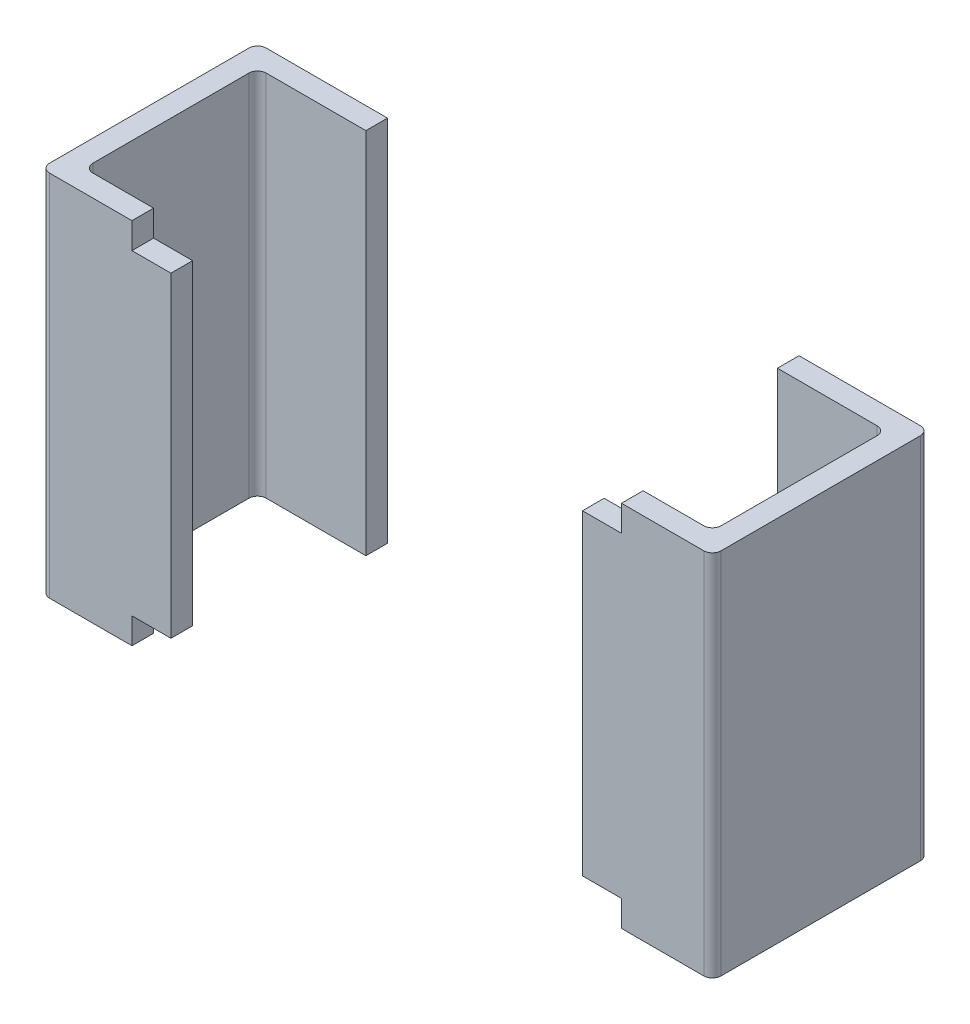
ISO-10303-21;
HEADER;
FILE_DESCRIPTION(('STEP AP214'),'2;1');
FILE_NAME('part.step','',(''),(''),'','','');
FILE_SCHEMA(('AUTOMOTIVE_DESIGN { 1 0 10303 214 1 1 1 1 }'));
ENDSEC;
DATA;
#1=APPLICATION_CONTEXT('core data for automotive mechanical design processes');
#2=APPLICATION_PROTOCOL_DEFINITION('international standard','automotive_design',2000,#1);
#3=PRODUCT_CONTEXT('',#1,'mechanical');
#4=PRODUCT('Part','Part','',(#3));
#5=PRODUCT_RELATED_PRODUCT_CATEGORY('part','',(#4));
#6=PRODUCT_DEFINITION_FORMATION('','',#4);
#7=PRODUCT_DEFINITION_CONTEXT('part definition',#1,'design');
#8=PRODUCT_DEFINITION('design','',#6,#7);
#9=PRODUCT_DEFINITION_SHAPE('','',#8);
#10=(LENGTH_UNIT() NAMED_UNIT(*) SI_UNIT(.MILLI.,.METRE.));
#11=(NAMED_UNIT(*) PLANE_ANGLE_UNIT() SI_UNIT($,.RADIAN.));
#12=(NAMED_UNIT(*) SI_UNIT($,.STERADIAN.) SOLID_ANGLE_UNIT());
#13=UNCERTAINTY_MEASURE_WITH_UNIT(LENGTH_MEASURE(1.E-05),#10,'distance_accuracy_value','');
#14=(GEOMETRIC_REPRESENTATION_CONTEXT(3) GLOBAL_UNCERTAINTY_ASSIGNED_CONTEXT((#13)) GLOBAL_UNIT_ASSIGNED_CONTEXT((#10,
#11,#12)) REPRESENTATION_CONTEXT('',''));
#15=CARTESIAN_POINT('',(0.,0.,0.));
#16=DIRECTION('',(0.,0.,1.));
#17=DIRECTION('',(1.,0.,0.));
#18=AXIS2_PLACEMENT_3D('',#15,#16,#17);
#19=CARTESIAN_POINT('',(-0.705,0.425,0.43));
#20=DIRECTION('',(0.,1.,0.));
#21=DIRECTION('',(-0.707106781186548,0.,0.707106781186548));
#22=AXIS2_PLACEMENT_3D('',#19,#20,#21);
#23=CYLINDRICAL_SURFACE('',#22,0.02);
#24=CARTESIAN_POINT('',(-0.705,-0.425,0.43));
#25=DIRECTION('',(0.,-1.,0.));
#26=DIRECTION('',(-0.707106781186548,0.,0.707106781186548));
#27=AXIS2_PLACEMENT_3D('',#24,#25,#26);
#28=CIRCLE('',#27,0.02);
#29=CARTESIAN_POINT('',(-0.705,-0.425,0.45));
#30=VERTEX_POINT('',#29);
#31=CARTESIAN_POINT('',(-0.725,-0.425,0.43));
#32=VERTEX_POINT('',#31);
#33=EDGE_CURVE('P0_E11',#30,#32,#28,.T.);
#34=ORIENTED_EDGE('',*,*,#33,.T.);
#35=DIRECTION('',(0.,1.,0.));
#36=VECTOR('',#35,1.);
#37=CARTESIAN_POINT('',(-0.725,0.425,0.43));
#38=LINE('',#37,#36);
#39=CARTESIAN_POINT('',(-0.725,0.425,0.43));
#40=VERTEX_POINT('',#39);
#41=EDGE_CURVE('P0_E27',#32,#40,#38,.T.);
#42=ORIENTED_EDGE('',*,*,#41,.T.);
#43=CARTESIAN_POINT('',(-0.705,0.425,0.43));
#44=DIRECTION('',(0.,1.,0.));
#45=DIRECTION('',(-0.707106781186548,0.,0.707106781186548));
#46=AXIS2_PLACEMENT_3D('',#43,#44,#45);
#47=CIRCLE('',#46,0.02);
#48=CARTESIAN_POINT('',(-0.705,0.425,0.45));
#49=VERTEX_POINT('',#48);
#50=EDGE_CURVE('P0_E213',#40,#49,#47,.T.);
#51=ORIENTED_EDGE('',*,*,#50,.T.);
#52=DIRECTION('',(0.,-1.,0.));
#53=VECTOR('',#52,1.);
#54=CARTESIAN_POINT('',(-0.705,0.425,0.45));
#55=LINE('',#54,#53);
#56=EDGE_CURVE('P0_E170',#49,#30,#55,.T.);
#57=ORIENTED_EDGE('',*,*,#56,.T.);
#58=EDGE_LOOP('',(#34,#42,#51,#57));
#59=FACE_BOUND('',#58,.T.);
#60=ADVANCED_FACE('P0_F16',(#59),#23,.F.);
#61=CARTESIAN_POINT('',(-0.725,0.425,0.05));
#62=DIRECTION('',(-1.,0.,0.));
#63=DIRECTION('',(0.,1.,0.));
#64=AXIS2_PLACEMENT_3D('',#61,#62,#63);
#65=PLANE('',#64);
#66=ORIENTED_EDGE('',*,*,#41,.F.);
#67=DIRECTION('',(0.,0.,1.));
#68=VECTOR('',#67,1.);
#69=CARTESIAN_POINT('',(-0.725,-0.425,0.025));
#70=LINE('',#69,#68);
#71=CARTESIAN_POINT('',(-0.725,-0.425,0.07));
#72=VERTEX_POINT('',#71);
#73=EDGE_CURVE('P0_E267',#72,#32,#70,.T.);
#74=ORIENTED_EDGE('',*,*,#73,.F.);
#75=DIRECTION('',(0.,-1.,0.));
#76=VECTOR('',#75,1.);
#77=CARTESIAN_POINT('',(-0.725,0.425,0.07));
#78=LINE('',#77,#76);
#79=CARTESIAN_POINT('',(-0.725,0.425,0.07));
#80=VERTEX_POINT('',#79);
#81=EDGE_CURVE('P0_E203',#80,#72,#78,.T.);
#82=ORIENTED_EDGE('',*,*,#81,.F.);
#83=DIRECTION('',(0.,0.,-1.));
#84=VECTOR('',#83,1.);
#85=CARTESIAN_POINT('',(-0.725,0.425,0.025));
#86=LINE('',#85,#84);
#87=EDGE_CURVE('P0_E245',#40,#80,#86,.T.);
#88=ORIENTED_EDGE('',*,*,#87,.F.);
#89=EDGE_LOOP('',(#66,#74,#82,#88));
#90=FACE_BOUND('',#89,.T.);
#91=ADVANCED_FACE('P0_F548',(#90),#65,.F.);
#92=CARTESIAN_POINT('',(-0.755,0.2125,0.48));
#93=DIRECTION('',(0.,-1.,0.));
#94=DIRECTION('',(-0.707106781186548,0.,0.707106781186548));
#95=AXIS2_PLACEMENT_3D('',#92,#93,#94);
#96=CYLINDRICAL_SURFACE('',#95,0.02);
#97=CARTESIAN_POINT('',(-0.755,-0.425,0.48));
#98=DIRECTION('',(0.,1.,0.));
#99=DIRECTION('',(-0.707106781186548,0.,0.707106781186548));
#100=AXIS2_PLACEMENT_3D('',#97,#98,#99);
#101=CIRCLE('',#100,0.02);
#102=CARTESIAN_POINT('',(-0.775,-0.425,0.48));
#103=VERTEX_POINT('',#102);
#104=CARTESIAN_POINT('',(-0.755,-0.425,0.5));
#105=VERTEX_POINT('',#104);
#106=EDGE_CURVE('P0_E156',#103,#105,#101,.T.);
#107=ORIENTED_EDGE('',*,*,#106,.T.);
#108=DIRECTION('',(0.,1.,0.));
#109=VECTOR('',#108,1.);
#110=CARTESIAN_POINT('',(-0.755,0.2125,0.5));
#111=LINE('',#110,#109);
#112=CARTESIAN_POINT('',(-0.755,0.425,0.5));
#113=VERTEX_POINT('',#112);
#114=EDGE_CURVE('P0_E171',#105,#113,#111,.T.);
#115=ORIENTED_EDGE('',*,*,#114,.T.);
#116=CARTESIAN_POINT('',(-0.755,0.425,0.48));
#117=DIRECTION('',(0.,-1.,0.));
#118=DIRECTION('',(-0.707106781186548,0.,0.707106781186548));
#119=AXIS2_PLACEMENT_3D('',#116,#117,#118);
#120=CIRCLE('',#119,0.02);
#121=CARTESIAN_POINT('',(-0.775,0.425,0.48));
#122=VERTEX_POINT('',#121);
#123=EDGE_CURVE('P0_E158',#113,#122,#120,.T.);
#124=ORIENTED_EDGE('',*,*,#123,.T.);
#125=DIRECTION('',(0.,-1.,0.));
#126=VECTOR('',#125,1.);
#127=CARTESIAN_POINT('',(-0.775,0.2125,0.48));
#128=LINE('',#127,#126);
#129=EDGE_CURVE('P0_E145',#122,#103,#128,.T.);
#130=ORIENTED_EDGE('',*,*,#129,.T.);
#131=EDGE_LOOP('',(#107,#115,#124,#130));
#132=FACE_BOUND('',#131,.T.);
#133=ADVANCED_FACE('P0_F154',(#132),#96,.T.);
#134=CARTESIAN_POINT('',(0.,0.,0.5));
#135=DIRECTION('',(0.,0.,1.));
#136=DIRECTION('',(1.,0.,0.));
#137=AXIS2_PLACEMENT_3D('',#134,#135,#136);
#138=PLANE('',#137);
#139=ORIENTED_EDGE('',*,*,#114,.F.);
#140=DIRECTION('',(1.,0.,0.));
#141=VECTOR('',#140,1.);
#142=CARTESIAN_POINT('',(-0.775,-0.425,0.5));
#143=LINE('',#142,#141);
#144=CARTESIAN_POINT('',(-0.565,-0.425,0.5));
#145=VERTEX_POINT('',#144);
#146=EDGE_CURVE('P0_E161',#105,#145,#143,.T.);
#147=ORIENTED_EDGE('',*,*,#146,.T.);
#148=DIRECTION('',(0.,1.,0.));
#149=VECTOR('',#148,1.);
#150=CARTESIAN_POINT('',(-0.565,-0.2125,0.5));
#151=LINE('',#150,#149);
#152=CARTESIAN_POINT('',(-0.565,-0.365,0.5));
#153=VERTEX_POINT('',#152);
#154=EDGE_CURVE('P0_E224',#145,#153,#151,.T.);
#155=ORIENTED_EDGE('',*,*,#154,.T.);
#156=DIRECTION('',(1.,0.,0.));
#157=VECTOR('',#156,1.);
#158=CARTESIAN_POINT('',(-0.2825,-0.365,0.5));
#159=LINE('',#158,#157);
#160=CARTESIAN_POINT('',(-0.475,-0.365,0.5));
#161=VERTEX_POINT('',#160);
#162=EDGE_CURVE('P0_E229',#153,#161,#159,.T.);
#163=ORIENTED_EDGE('',*,*,#162,.T.);
#164=DIRECTION('',(0.,1.,0.));
#165=VECTOR('',#164,1.);
#166=CARTESIAN_POINT('',(-0.475,0.2125,0.5));
#167=LINE('',#166,#165);
#168=CARTESIAN_POINT('',(-0.475,0.365,0.5));
#169=VERTEX_POINT('',#168);
#170=EDGE_CURVE('P0_E226',#161,#169,#167,.T.);
#171=ORIENTED_EDGE('',*,*,#170,.T.);
#172=DIRECTION('',(-1.,0.,0.));
#173=VECTOR('',#172,1.);
#174=CARTESIAN_POINT('',(-0.2375,0.365,0.5));
#175=LINE('',#174,#173);
#176=CARTESIAN_POINT('',(-0.565,0.365,0.5));
#177=VERTEX_POINT('',#176);
#178=EDGE_CURVE('P0_E100',#169,#177,#175,.T.);
#179=ORIENTED_EDGE('',*,*,#178,.T.);
#180=DIRECTION('',(0.,1.,0.));
#181=VECTOR('',#180,1.);
#182=CARTESIAN_POINT('',(-0.565,0.1825,0.5));
#183=LINE('',#182,#181);
#184=CARTESIAN_POINT('',(-0.565,0.425,0.5));
#185=VERTEX_POINT('',#184);
#186=EDGE_CURVE('P0_E20',#177,#185,#183,.T.);
#187=ORIENTED_EDGE('',*,*,#186,.T.);
#188=DIRECTION('',(-1.,0.,0.));
#189=VECTOR('',#188,1.);
#190=CARTESIAN_POINT('',(0.775,0.425,0.5));
#191=LINE('',#190,#189);
#192=EDGE_CURVE('P0_E254',#185,#113,#191,.T.);
#193=ORIENTED_EDGE('',*,*,#192,.T.);
#194=EDGE_LOOP('',(#139,#147,#155,#163,#171,#179,#187,#193));
#195=FACE_BOUND('',#194,.T.);
#196=ADVANCED_FACE('P0_F381',(#195),#138,.T.);
#197=CARTESIAN_POINT('',(-0.775,-0.425,0.));
#198=DIRECTION('',(0.,-1.,0.));
#199=DIRECTION('',(0.,0.,-1.));
#200=AXIS2_PLACEMENT_3D('',#197,#198,#199);
#201=PLANE('',#200);
#202=ORIENTED_EDGE('',*,*,#106,.F.);
#203=DIRECTION('',(0.,0.,1.));
#204=VECTOR('',#203,1.);
#205=CARTESIAN_POINT('',(-0.775,-0.425,0.));
#206=LINE('',#205,#204);
#207=CARTESIAN_POINT('',(-0.775,-0.425,0.02));
#208=VERTEX_POINT('',#207);
#209=EDGE_CURVE('P0_E165',#208,#103,#206,.T.);
#210=ORIENTED_EDGE('',*,*,#209,.F.);
#211=CARTESIAN_POINT('',(-0.755,-0.425,0.02));
#212=DIRECTION('',(0.,1.,0.));
#213=DIRECTION('',(-0.707106781186548,0.,-0.707106781186548));
#214=AXIS2_PLACEMENT_3D('',#211,#212,#213);
#215=CIRCLE('',#214,0.02);
#216=CARTESIAN_POINT('',(-0.755,-0.425,0.));
#217=VERTEX_POINT('',#216);
#218=EDGE_CURVE('P0_E235',#217,#208,#215,.T.);
#219=ORIENTED_EDGE('',*,*,#218,.F.);
#220=DIRECTION('',(1.,0.,0.));
#221=VECTOR('',#220,1.);
#222=CARTESIAN_POINT('',(-0.775,-0.425,0.));
#223=LINE('',#222,#221);
#224=CARTESIAN_POINT('',(-0.475,-0.425,0.));
#225=VERTEX_POINT('',#224);
#226=EDGE_CURVE('P0_E250',#217,#225,#223,.T.);
#227=ORIENTED_EDGE('',*,*,#226,.T.);
#228=DIRECTION('',(0.,0.,1.));
#229=VECTOR('',#228,1.);
#230=CARTESIAN_POINT('',(-0.475,-0.425,-0.01854871206285));
#231=LINE('',#230,#229);
#232=CARTESIAN_POINT('',(-0.475,-0.425,0.05));
#233=VERTEX_POINT('',#232);
#234=EDGE_CURVE('P0_E255',#225,#233,#231,.T.);
#235=ORIENTED_EDGE('',*,*,#234,.T.);
#236=DIRECTION('',(-1.,0.,0.));
#237=VECTOR('',#236,1.);
#238=CARTESIAN_POINT('',(-0.025,-0.425,0.05));
#239=LINE('',#238,#237);
#240=CARTESIAN_POINT('',(-0.705,-0.425,0.05));
#241=VERTEX_POINT('',#240);
#242=EDGE_CURVE('P0_E263',#233,#241,#239,.T.);
#243=ORIENTED_EDGE('',*,*,#242,.T.);
#244=CARTESIAN_POINT('',(-0.705,-0.425,0.07));
#245=DIRECTION('',(0.,-1.,0.));
#246=DIRECTION('',(-0.707106781186548,0.,-0.707106781186548));
#247=AXIS2_PLACEMENT_3D('',#244,#245,#246);
#248=CIRCLE('',#247,0.02);
#249=EDGE_CURVE('P0_E194',#72,#241,#248,.T.);
#250=ORIENTED_EDGE('',*,*,#249,.F.);
#251=ORIENTED_EDGE('',*,*,#73,.T.);
#252=ORIENTED_EDGE('',*,*,#33,.F.);
#253=DIRECTION('',(1.,0.,0.));
#254=VECTOR('',#253,1.);
#255=CARTESIAN_POINT('',(-0.75,-0.425,0.45));
#256=LINE('',#255,#254);
#257=CARTESIAN_POINT('',(-0.565,-0.425,0.45));
#258=VERTEX_POINT('',#257);
#259=EDGE_CURVE('P0_E262',#30,#258,#256,.T.);
#260=ORIENTED_EDGE('',*,*,#259,.T.);
#261=DIRECTION('',(0.,0.,1.));
#262=VECTOR('',#261,1.);
#263=CARTESIAN_POINT('',(-0.565,-0.425,0.25));
#264=LINE('',#263,#262);
#265=EDGE_CURVE('P0_E238',#258,#145,#264,.T.);
#266=ORIENTED_EDGE('',*,*,#265,.T.);
#267=ORIENTED_EDGE('',*,*,#146,.F.);
#268=EDGE_LOOP('',(#202,#210,#219,#227,#235,#243,#250,#251,#252,#260,#266,#267));
#269=FACE_BOUND('',#268,.T.);
#270=ADVANCED_FACE('P0_F164',(#269),#201,.T.);
#271=CARTESIAN_POINT('',(-0.755,0.2125,0.02));
#272=DIRECTION('',(0.,-1.,0.));
#273=DIRECTION('',(-0.707106781186548,0.,-0.707106781186548));
#274=AXIS2_PLACEMENT_3D('',#271,#272,#273);
#275=CYLINDRICAL_SURFACE('',#274,0.02);
#276=ORIENTED_EDGE('',*,*,#218,.T.);
#277=DIRECTION('',(0.,1.,0.));
#278=VECTOR('',#277,1.);
#279=CARTESIAN_POINT('',(-0.775,0.2125,0.02));
#280=LINE('',#279,#278);
#281=CARTESIAN_POINT('',(-0.775,0.425,0.02));
#282=VERTEX_POINT('',#281);
#283=EDGE_CURVE('P0_E176',#208,#282,#280,.T.);
#284=ORIENTED_EDGE('',*,*,#283,.T.);
#285=CARTESIAN_POINT('',(-0.755,0.425,0.02));
#286=DIRECTION('',(0.,-1.,0.));
#287=DIRECTION('',(-0.707106781186548,0.,-0.707106781186548));
#288=AXIS2_PLACEMENT_3D('',#285,#286,#287);
#289=CIRCLE('',#288,0.02);
#290=CARTESIAN_POINT('',(-0.755,0.425,0.));
#291=VERTEX_POINT('',#290);
#292=EDGE_CURVE('P0_E289',#282,#291,#289,.T.);
#293=ORIENTED_EDGE('',*,*,#292,.T.);
#294=DIRECTION('',(0.,-1.,0.));
#295=VECTOR('',#294,1.);
#296=CARTESIAN_POINT('',(-0.755,0.2125,0.));
#297=LINE('',#296,#295);
#298=EDGE_CURVE('P0_E259',#291,#217,#297,.T.);
#299=ORIENTED_EDGE('',*,*,#298,.T.);
#300=EDGE_LOOP('',(#276,#284,#293,#299));
#301=FACE_BOUND('',#300,.T.);
#302=ADVANCED_FACE('P0_F318',(#301),#275,.T.);
#303=CARTESIAN_POINT('',(0.,0.,0.));
#304=DIRECTION('',(0.,0.,1.));
#305=DIRECTION('',(1.,0.,0.));
#306=AXIS2_PLACEMENT_3D('',#303,#304,#305);
#307=PLANE('',#306);
#308=ORIENTED_EDGE('',*,*,#298,.F.);
#309=DIRECTION('',(-1.,0.,0.));
#310=VECTOR('',#309,1.);
#311=CARTESIAN_POINT('',(0.775,0.425,0.));
#312=LINE('',#311,#310);
#313=CARTESIAN_POINT('',(-0.475,0.425,0.));
#314=VERTEX_POINT('',#313);
#315=EDGE_CURVE('P0_E214',#314,#291,#312,.T.);
#316=ORIENTED_EDGE('',*,*,#315,.F.);
#317=DIRECTION('',(0.,-1.,0.));
#318=VECTOR('',#317,1.);
#319=CARTESIAN_POINT('',(-0.475,0.2125,0.));
#320=LINE('',#319,#318);
#321=EDGE_CURVE('P0_E197',#314,#225,#320,.T.);
#322=ORIENTED_EDGE('',*,*,#321,.T.);
#323=ORIENTED_EDGE('',*,*,#226,.F.);
#324=EDGE_LOOP('',(#308,#316,#322,#323));
#325=FACE_BOUND('',#324,.T.);
#326=ADVANCED_FACE('P0_F325',(#325),#307,.F.);
#327=CARTESIAN_POINT('',(-0.705,0.425,0.07));
#328=DIRECTION('',(0.,1.,0.));
#329=DIRECTION('',(-0.707106781186548,0.,-0.707106781186548));
#330=AXIS2_PLACEMENT_3D('',#327,#328,#329);
#331=CYLINDRICAL_SURFACE('',#330,0.02);
#332=ORIENTED_EDGE('',*,*,#249,.T.);
#333=DIRECTION('',(0.,1.,0.));
#334=VECTOR('',#333,1.);
#335=CARTESIAN_POINT('',(-0.705,0.425,0.05));
#336=LINE('',#335,#334);
#337=CARTESIAN_POINT('',(-0.705,0.425,0.05));
#338=VERTEX_POINT('',#337);
#339=EDGE_CURVE('P0_E198',#241,#338,#336,.T.);
#340=ORIENTED_EDGE('',*,*,#339,.T.);
#341=CARTESIAN_POINT('',(-0.705,0.425,0.07));
#342=DIRECTION('',(0.,1.,0.));
#343=DIRECTION('',(-0.707106781186548,0.,-0.707106781186548));
#344=AXIS2_PLACEMENT_3D('',#341,#342,#343);
#345=CIRCLE('',#344,0.02);
#346=EDGE_CURVE('P0_E222',#338,#80,#345,.T.);
#347=ORIENTED_EDGE('',*,*,#346,.T.);
#348=ORIENTED_EDGE('',*,*,#81,.T.);
#349=EDGE_LOOP('',(#332,#340,#347,#348));
#350=FACE_BOUND('',#349,.T.);
#351=ADVANCED_FACE('P0_F563',(#350),#331,.F.);
#352=CARTESIAN_POINT('',(0.725,0.425,0.05));
#353=DIRECTION('',(0.,0.,-1.));
#354=DIRECTION('',(0.,-1.,0.));
#355=AXIS2_PLACEMENT_3D('',#352,#353,#354);
#356=PLANE('',#355);
#357=ORIENTED_EDGE('',*,*,#339,.F.);
#358=ORIENTED_EDGE('',*,*,#242,.F.);
#359=DIRECTION('',(0.,1.,0.));
#360=VECTOR('',#359,1.);
#361=CARTESIAN_POINT('',(-0.475,0.425,0.05));
#362=LINE('',#361,#360);
#363=CARTESIAN_POINT('',(-0.475,0.425,0.05));
#364=VERTEX_POINT('',#363);
#365=EDGE_CURVE('P0_E199',#233,#364,#362,.T.);
#366=ORIENTED_EDGE('',*,*,#365,.T.);
#367=DIRECTION('',(1.,0.,0.));
#368=VECTOR('',#367,1.);
#369=CARTESIAN_POINT('',(0.75,0.425,0.05));
#370=LINE('',#369,#368);
#371=EDGE_CURVE('P0_E242',#338,#364,#370,.T.);
#372=ORIENTED_EDGE('',*,*,#371,.F.);
#373=EDGE_LOOP('',(#357,#358,#366,#372));
#374=FACE_BOUND('',#373,.T.);
#375=ADVANCED_FACE('P0_F565',(#374),#356,.F.);
#376=CARTESIAN_POINT('',(-0.565,-0.365,0.5));
#377=DIRECTION('',(0.,1.,0.));
#378=DIRECTION('',(1.,0.,0.));
#379=AXIS2_PLACEMENT_3D('',#376,#377,#378);
#380=PLANE('',#379);
#381=DIRECTION('',(-1.,0.,0.));
#382=VECTOR('',#381,1.);
#383=CARTESIAN_POINT('',(-0.645,-0.365,0.45));
#384=LINE('',#383,#382);
#385=CARTESIAN_POINT('',(-0.475,-0.365,0.45));
#386=VERTEX_POINT('',#385);
#387=CARTESIAN_POINT('',(-0.565,-0.365,0.45));
#388=VERTEX_POINT('',#387);
#389=EDGE_CURVE('P0_E205',#386,#388,#384,.T.);
#390=ORIENTED_EDGE('',*,*,#389,.F.);
#391=DIRECTION('',(0.,0.,-1.));
#392=VECTOR('',#391,1.);
#393=CARTESIAN_POINT('',(-0.475,-0.365,0.45));
#394=LINE('',#393,#392);
#395=EDGE_CURVE('P0_E187',#161,#386,#394,.T.);
#396=ORIENTED_EDGE('',*,*,#395,.F.);
#397=ORIENTED_EDGE('',*,*,#162,.F.);
#398=DIRECTION('',(0.,0.,-1.));
#399=VECTOR('',#398,1.);
#400=CARTESIAN_POINT('',(-0.565,-0.365,0.5));
#401=LINE('',#400,#399);
#402=EDGE_CURVE('P0_E204',#153,#388,#401,.T.);
#403=ORIENTED_EDGE('',*,*,#402,.T.);
#404=EDGE_LOOP('',(#390,#396,#397,#403));
#405=FACE_BOUND('',#404,.T.);
#406=ADVANCED_FACE('P0_F533',(#405),#380,.F.);
#407=CARTESIAN_POINT('',(-0.565,-0.425,0.5));
#408=DIRECTION('',(-1.,0.,0.));
#409=DIRECTION('',(0.,0.,1.));
#410=AXIS2_PLACEMENT_3D('',#407,#408,#409);
#411=PLANE('',#410);
#412=DIRECTION('',(0.,-1.,0.));
#413=VECTOR('',#412,1.);
#414=CARTESIAN_POINT('',(-0.565,0.,0.45));
#415=LINE('',#414,#413);
#416=EDGE_CURVE('P0_E210',#388,#258,#415,.T.);
#417=ORIENTED_EDGE('',*,*,#416,.F.);
#418=ORIENTED_EDGE('',*,*,#402,.F.);
#419=ORIENTED_EDGE('',*,*,#154,.F.);
#420=ORIENTED_EDGE('',*,*,#265,.F.);
#421=EDGE_LOOP('',(#417,#418,#419,#420));
#422=FACE_BOUND('',#421,.T.);
#423=ADVANCED_FACE('P0_F18',(#422),#411,.F.);
#424=CARTESIAN_POINT('',(-0.475,0.365,0.5));
#425=DIRECTION('',(0.,-1.,0.));
#426=DIRECTION('',(0.,0.,-1.));
#427=AXIS2_PLACEMENT_3D('',#424,#425,#426);
#428=PLANE('',#427);
#429=DIRECTION('',(1.,0.,0.));
#430=VECTOR('',#429,1.);
#431=CARTESIAN_POINT('',(-0.6,0.365,0.45));
#432=LINE('',#431,#430);
#433=CARTESIAN_POINT('',(-0.565,0.365,0.45));
#434=VERTEX_POINT('',#433);
#435=CARTESIAN_POINT('',(-0.475,0.365,0.45));
#436=VERTEX_POINT('',#435);
#437=EDGE_CURVE('P0_E307',#434,#436,#432,.T.);
#438=ORIENTED_EDGE('',*,*,#437,.F.);
#439=DIRECTION('',(0.,0.,-1.));
#440=VECTOR('',#439,1.);
#441=CARTESIAN_POINT('',(-0.565,0.365,0.5));
#442=LINE('',#441,#440);
#443=EDGE_CURVE('P0_E246',#177,#434,#442,.T.);
#444=ORIENTED_EDGE('',*,*,#443,.F.);
#445=ORIENTED_EDGE('',*,*,#178,.F.);
#446=DIRECTION('',(0.,0.,1.));
#447=VECTOR('',#446,1.);
#448=CARTESIAN_POINT('',(-0.475,0.365,0.45));
#449=LINE('',#448,#447);
#450=EDGE_CURVE('P0_E178',#436,#169,#449,.T.);
#451=ORIENTED_EDGE('',*,*,#450,.F.);
#452=EDGE_LOOP('',(#438,#444,#445,#451));
#453=FACE_BOUND('',#452,.T.);
#454=ADVANCED_FACE('P0_F536',(#453),#428,.F.);
#455=CARTESIAN_POINT('',(-0.565,0.365,0.5));
#456=DIRECTION('',(-1.,0.,0.));
#457=DIRECTION('',(0.,0.,1.));
#458=AXIS2_PLACEMENT_3D('',#455,#456,#457);
#459=PLANE('',#458);
#460=DIRECTION('',(0.,-1.,0.));
#461=VECTOR('',#460,1.);
#462=CARTESIAN_POINT('',(-0.565,0.395,0.45));
#463=LINE('',#462,#461);
#464=CARTESIAN_POINT('',(-0.565,0.425,0.45));
#465=VERTEX_POINT('',#464);
#466=EDGE_CURVE('P0_E249',#465,#434,#463,.T.);
#467=ORIENTED_EDGE('',*,*,#466,.F.);
#468=DIRECTION('',(0.,0.,-1.));
#469=VECTOR('',#468,1.);
#470=CARTESIAN_POINT('',(-0.565,0.425,0.25));
#471=LINE('',#470,#469);
#472=EDGE_CURVE('P0_E179',#185,#465,#471,.T.);
#473=ORIENTED_EDGE('',*,*,#472,.F.);
#474=ORIENTED_EDGE('',*,*,#186,.F.);
#475=ORIENTED_EDGE('',*,*,#443,.T.);
#476=EDGE_LOOP('',(#467,#473,#474,#475));
#477=FACE_BOUND('',#476,.T.);
#478=ADVANCED_FACE('P0_F367',(#477),#459,.F.);
#479=CARTESIAN_POINT('',(-0.725,0.425,0.45));
#480=DIRECTION('',(0.,0.,1.));
#481=DIRECTION('',(1.,0.,0.));
#482=AXIS2_PLACEMENT_3D('',#479,#480,#481);
#483=PLANE('',#482);
#484=ORIENTED_EDGE('',*,*,#56,.F.);
#485=DIRECTION('',(-1.,0.,0.));
#486=VECTOR('',#485,1.);
#487=CARTESIAN_POINT('',(0.025,0.425,0.45));
#488=LINE('',#487,#486);
#489=EDGE_CURVE('P0_E189',#465,#49,#488,.T.);
#490=ORIENTED_EDGE('',*,*,#489,.F.);
#491=ORIENTED_EDGE('',*,*,#466,.T.);
#492=ORIENTED_EDGE('',*,*,#437,.T.);
#493=DIRECTION('',(0.,-1.,0.));
#494=VECTOR('',#493,1.);
#495=CARTESIAN_POINT('',(-0.475,0.425,0.45));
#496=LINE('',#495,#494);
#497=EDGE_CURVE('P0_E209',#436,#386,#496,.T.);
#498=ORIENTED_EDGE('',*,*,#497,.T.);
#499=ORIENTED_EDGE('',*,*,#389,.T.);
#500=ORIENTED_EDGE('',*,*,#416,.T.);
#501=ORIENTED_EDGE('',*,*,#259,.F.);
#502=EDGE_LOOP('',(#484,#490,#491,#492,#498,#499,#500,#501));
#503=FACE_BOUND('',#502,.T.);
#504=ADVANCED_FACE('P0_F362',(#503),#483,.F.);
#505=CARTESIAN_POINT('',(-0.475,0.425,0.4));
#506=DIRECTION('',(-1.,0.,0.));
#507=DIRECTION('',(0.,1.,0.));
#508=AXIS2_PLACEMENT_3D('',#505,#506,#507);
#509=PLANE('',#508);
#510=ORIENTED_EDGE('',*,*,#395,.T.);
#511=ORIENTED_EDGE('',*,*,#497,.F.);
#512=ORIENTED_EDGE('',*,*,#450,.T.);
#513=ORIENTED_EDGE('',*,*,#170,.F.);
#514=EDGE_LOOP('',(#510,#511,#512,#513));
#515=FACE_BOUND('',#514,.T.);
#516=ADVANCED_FACE('P0_F531',(#515),#509,.F.);
#517=CARTESIAN_POINT('',(-0.775,0.425,0.));
#518=DIRECTION('',(-1.,0.,0.));
#519=DIRECTION('',(0.,0.,1.));
#520=AXIS2_PLACEMENT_3D('',#517,#518,#519);
#521=PLANE('',#520);
#522=ORIENTED_EDGE('',*,*,#129,.F.);
#523=DIRECTION('',(0.,0.,1.));
#524=VECTOR('',#523,1.);
#525=CARTESIAN_POINT('',(-0.775,0.425,0.));
#526=LINE('',#525,#524);
#527=EDGE_CURVE('P0_E218',#282,#122,#526,.T.);
#528=ORIENTED_EDGE('',*,*,#527,.F.);
#529=ORIENTED_EDGE('',*,*,#283,.F.);
#530=ORIENTED_EDGE('',*,*,#209,.T.);
#531=EDGE_LOOP('',(#522,#528,#529,#530));
#532=FACE_BOUND('',#531,.T.);
#533=ADVANCED_FACE('P0_F174',(#532),#521,.T.);
#534=CARTESIAN_POINT('',(0.775,0.425,0.));
#535=DIRECTION('',(0.,1.,0.));
#536=DIRECTION('',(1.,0.,0.));
#537=AXIS2_PLACEMENT_3D('',#534,#535,#536);
#538=PLANE('',#537);
#539=ORIENTED_EDGE('',*,*,#123,.F.);
#540=ORIENTED_EDGE('',*,*,#192,.F.);
#541=ORIENTED_EDGE('',*,*,#472,.T.);
#542=ORIENTED_EDGE('',*,*,#489,.T.);
#543=ORIENTED_EDGE('',*,*,#50,.F.);
#544=ORIENTED_EDGE('',*,*,#87,.T.);
#545=ORIENTED_EDGE('',*,*,#346,.F.);
#546=ORIENTED_EDGE('',*,*,#371,.T.);
#547=DIRECTION('',(0.,0.,-1.));
#548=VECTOR('',#547,1.);
#549=CARTESIAN_POINT('',(-0.475,0.425,-0.01854871206285));
#550=LINE('',#549,#548);
#551=EDGE_CURVE('P0_E217',#364,#314,#550,.T.);
#552=ORIENTED_EDGE('',*,*,#551,.T.);
#553=ORIENTED_EDGE('',*,*,#315,.T.);
#554=ORIENTED_EDGE('',*,*,#292,.F.);
#555=ORIENTED_EDGE('',*,*,#527,.T.);
#556=EDGE_LOOP('',(#539,#540,#541,#542,#543,#544,#545,#546,#552,#553,#554,#555));
#557=FACE_BOUND('',#556,.T.);
#558=ADVANCED_FACE('P0_F320',(#557),#538,.T.);
#559=CARTESIAN_POINT('',(-0.475,0.425,-0.03709742412571));
#560=DIRECTION('',(-1.,0.,0.));
#561=DIRECTION('',(0.,1.,0.));
#562=AXIS2_PLACEMENT_3D('',#559,#560,#561);
#563=PLANE('',#562);
#564=ORIENTED_EDGE('',*,*,#234,.F.);
#565=ORIENTED_EDGE('',*,*,#321,.F.);
#566=ORIENTED_EDGE('',*,*,#551,.F.);
#567=ORIENTED_EDGE('',*,*,#365,.F.);
#568=EDGE_LOOP('',(#564,#565,#566,#567));
#569=FACE_BOUND('',#568,.T.);
#570=ADVANCED_FACE('P0_F328',(#569),#563,.F.);
#571=CLOSED_SHELL('',(#60,#91,#133,#196,#270,#302,#326,#351,#375,#406,#423,#454,#478,#504,#516,
#533,#558,#570));
#572=MANIFOLD_SOLID_BREP('P0_B1',#571);
#573=CARTESIAN_POINT('',(0.705,0.425,0.07));
#574=DIRECTION('',(0.,-1.,0.));
#575=DIRECTION('',(0.707106781186548,0.,-0.707106781186548));
#576=AXIS2_PLACEMENT_3D('',#573,#574,#575);
#577=CYLINDRICAL_SURFACE('',#576,0.02);
#578=CARTESIAN_POINT('',(0.705,0.425,0.07));
#579=DIRECTION('',(0.,1.,0.));
#580=DIRECTION('',(0.707106781186548,0.,-0.707106781186548));
#581=AXIS2_PLACEMENT_3D('',#578,#579,#580);
#582=CIRCLE('',#581,0.02);
#583=CARTESIAN_POINT('',(0.725,0.425,0.07));
#584=VERTEX_POINT('',#583);
#585=CARTESIAN_POINT('',(0.705,0.425,0.05));
#586=VERTEX_POINT('',#585);
#587=EDGE_CURVE('P1_E11',#584,#586,#582,.T.);
#588=ORIENTED_EDGE('',*,*,#587,.T.);
#589=DIRECTION('',(0.,-1.,0.));
#590=VECTOR('',#589,1.);
#591=CARTESIAN_POINT('',(0.705,0.425,0.05));
#592=LINE('',#591,#590);
#593=CARTESIAN_POINT('',(0.705,-0.425,0.05));
#594=VERTEX_POINT('',#593);
#595=EDGE_CURVE('P1_E27',#586,#594,#592,.T.);
#596=ORIENTED_EDGE('',*,*,#595,.T.);
#597=CARTESIAN_POINT('',(0.705,-0.425,0.07));
#598=DIRECTION('',(0.,-1.,0.));
#599=DIRECTION('',(0.707106781186548,0.,-0.707106781186548));
#600=AXIS2_PLACEMENT_3D('',#597,#598,#599);
#601=CIRCLE('',#600,0.02);
#602=CARTESIAN_POINT('',(0.725,-0.425,0.07));
#603=VERTEX_POINT('',#602);
#604=EDGE_CURVE('P1_E158',#594,#603,#601,.T.);
#605=ORIENTED_EDGE('',*,*,#604,.T.);
#606=DIRECTION('',(0.,1.,0.));
#607=VECTOR('',#606,1.);
#608=CARTESIAN_POINT('',(0.725,0.425,0.07));
#609=LINE('',#608,#607);
#610=EDGE_CURVE('P1_E171',#603,#584,#609,.T.);
#611=ORIENTED_EDGE('',*,*,#610,.T.);
#612=EDGE_LOOP('',(#588,#596,#605,#611));
#613=FACE_BOUND('',#612,.T.);
#614=ADVANCED_FACE('P1_F16',(#613),#577,.F.);
#615=CARTESIAN_POINT('',(0.725,0.425,0.05));
#616=DIRECTION('',(0.,0.,-1.));
#617=DIRECTION('',(0.,-1.,0.));
#618=AXIS2_PLACEMENT_3D('',#615,#616,#617);
#619=PLANE('',#618);
#620=ORIENTED_EDGE('',*,*,#595,.F.);
#621=DIRECTION('',(1.,0.,0.));
#622=VECTOR('',#621,1.);
#623=CARTESIAN_POINT('',(0.75,0.425,0.05));
#624=LINE('',#623,#622);
#625=CARTESIAN_POINT('',(0.475,0.425,0.05));
#626=VERTEX_POINT('',#625);
#627=EDGE_CURVE('P1_E166',#626,#586,#624,.T.);
#628=ORIENTED_EDGE('',*,*,#627,.F.);
#629=DIRECTION('',(0.,-1.,0.));
#630=VECTOR('',#629,1.);
#631=CARTESIAN_POINT('',(0.475,0.425,0.05));
#632=LINE('',#631,#630);
#633=CARTESIAN_POINT('',(0.475,-0.425,0.05));
#634=VERTEX_POINT('',#633);
#635=EDGE_CURVE('P1_E163',#626,#634,#632,.T.);
#636=ORIENTED_EDGE('',*,*,#635,.T.);
#637=DIRECTION('',(-1.,0.,0.));
#638=VECTOR('',#637,1.);
#639=CARTESIAN_POINT('',(-0.025,-0.425,0.05));
#640=LINE('',#639,#638);
#641=EDGE_CURVE('P1_E150',#594,#634,#640,.T.);
#642=ORIENTED_EDGE('',*,*,#641,.F.);
#643=EDGE_LOOP('',(#620,#628,#636,#642));
#644=FACE_BOUND('',#643,.T.);
#645=ADVANCED_FACE('P1_F164',(#644),#619,.F.);
#646=CARTESIAN_POINT('',(0.755,-0.2125,0.02));
#647=DIRECTION('',(0.,1.,0.));
#648=DIRECTION('',(0.707106781186548,0.,-0.707106781186548));
#649=AXIS2_PLACEMENT_3D('',#646,#647,#648);
#650=CYLINDRICAL_SURFACE('',#649,0.02);
#651=CARTESIAN_POINT('',(0.755,0.425,0.02));
#652=DIRECTION('',(0.,-1.,0.));
#653=DIRECTION('',(0.707106781186548,0.,-0.707106781186548));
#654=AXIS2_PLACEMENT_3D('',#651,#652,#653);
#655=CIRCLE('',#654,0.02);
#656=CARTESIAN_POINT('',(0.755,0.425,0.));
#657=VERTEX_POINT('',#656);
#658=CARTESIAN_POINT('',(0.775,0.425,0.02));
#659=VERTEX_POINT('',#658);
#660=EDGE_CURVE('P1_E172',#657,#659,#655,.T.);
#661=ORIENTED_EDGE('',*,*,#660,.T.);
#662=DIRECTION('',(0.,-1.,0.));
#663=VECTOR('',#662,1.);
#664=CARTESIAN_POINT('',(0.775,-0.2125,0.02));
#665=LINE('',#664,#663);
#666=CARTESIAN_POINT('',(0.775,-0.425,0.02));
#667=VERTEX_POINT('',#666);
#668=EDGE_CURVE('P1_E207',#659,#667,#665,.T.);
#669=ORIENTED_EDGE('',*,*,#668,.T.);
#670=CARTESIAN_POINT('',(0.755,-0.425,0.02));
#671=DIRECTION('',(0.,1.,0.));
#672=DIRECTION('',(0.707106781186548,0.,-0.707106781186548));
#673=AXIS2_PLACEMENT_3D('',#670,#671,#672);
#674=CIRCLE('',#673,0.02);
#675=CARTESIAN_POINT('',(0.755,-0.425,0.));
#676=VERTEX_POINT('',#675);
#677=EDGE_CURVE('P1_E290',#667,#676,#674,.T.);
#678=ORIENTED_EDGE('',*,*,#677,.T.);
#679=DIRECTION('',(0.,1.,0.));
#680=VECTOR('',#679,1.);
#681=CARTESIAN_POINT('',(0.755,-0.2125,0.));
#682=LINE('',#681,#680);
#683=EDGE_CURVE('P1_E202',#676,#657,#682,.T.);
#684=ORIENTED_EDGE('',*,*,#683,.T.);
#685=EDGE_LOOP('',(#661,#669,#678,#684));
#686=FACE_BOUND('',#685,.T.);
#687=ADVANCED_FACE('P1_F378',(#686),#650,.T.);
#688=CARTESIAN_POINT('',(0.,0.,0.));
#689=DIRECTION('',(0.,0.,1.));
#690=DIRECTION('',(1.,0.,0.));
#691=AXIS2_PLACEMENT_3D('',#688,#689,#690);
#692=PLANE('',#691);
#693=ORIENTED_EDGE('',*,*,#683,.F.);
#694=DIRECTION('',(1.,0.,0.));
#695=VECTOR('',#694,1.);
#696=CARTESIAN_POINT('',(-0.775,-0.425,0.));
#697=LINE('',#696,#695);
#698=CARTESIAN_POINT('',(0.475,-0.425,0.));
#699=VERTEX_POINT('',#698);
#700=EDGE_CURVE('P1_E179',#699,#676,#697,.T.);
#701=ORIENTED_EDGE('',*,*,#700,.F.);
#702=DIRECTION('',(0.,1.,0.));
#703=VECTOR('',#702,1.);
#704=CARTESIAN_POINT('',(0.475,0.2125,0.));
#705=LINE('',#704,#703);
#706=CARTESIAN_POINT('',(0.475,0.425,0.));
#707=VERTEX_POINT('',#706);
#708=EDGE_CURVE('P1_E177',#699,#707,#705,.T.);
#709=ORIENTED_EDGE('',*,*,#708,.T.);
#710=DIRECTION('',(-1.,0.,0.));
#711=VECTOR('',#710,1.);
#712=CARTESIAN_POINT('',(0.775,0.425,0.));
#713=LINE('',#712,#711);
#714=EDGE_CURVE('P1_E262',#657,#707,#713,.T.);
#715=ORIENTED_EDGE('',*,*,#714,.F.);
#716=EDGE_LOOP('',(#693,#701,#709,#715));
#717=FACE_BOUND('',#716,.T.);
#718=ADVANCED_FACE('P1_F376',(#717),#692,.F.);
#719=CARTESIAN_POINT('',(-0.775,-0.425,0.));
#720=DIRECTION('',(0.,-1.,0.));
#721=DIRECTION('',(0.,0.,-1.));
#722=AXIS2_PLACEMENT_3D('',#719,#720,#721);
#723=PLANE('',#722);
#724=ORIENTED_EDGE('',*,*,#677,.F.);
#725=DIRECTION('',(0.,0.,1.));
#726=VECTOR('',#725,1.);
#727=CARTESIAN_POINT('',(0.775,-0.425,0.));
#728=LINE('',#727,#726);
#729=CARTESIAN_POINT('',(0.775,-0.425,0.48));
#730=VERTEX_POINT('',#729);
#731=EDGE_CURVE('P1_E203',#667,#730,#728,.T.);
#732=ORIENTED_EDGE('',*,*,#731,.T.);
#733=CARTESIAN_POINT('',(0.755,-0.425,0.48));
#734=DIRECTION('',(0.,1.,0.));
#735=DIRECTION('',(0.707106781186548,0.,0.707106781186548));
#736=AXIS2_PLACEMENT_3D('',#733,#734,#735);
#737=CIRCLE('',#736,0.02);
#738=CARTESIAN_POINT('',(0.755,-0.425,0.5));
#739=VERTEX_POINT('',#738);
#740=EDGE_CURVE('P1_E226',#739,#730,#737,.T.);
#741=ORIENTED_EDGE('',*,*,#740,.F.);
#742=DIRECTION('',(1.,0.,0.));
#743=VECTOR('',#742,1.);
#744=CARTESIAN_POINT('',(-0.775,-0.425,0.5));
#745=LINE('',#744,#743);
#746=CARTESIAN_POINT('',(0.565,-0.425,0.5));
#747=VERTEX_POINT('',#746);
#748=EDGE_CURVE('P1_E199',#747,#739,#745,.T.);
#749=ORIENTED_EDGE('',*,*,#748,.F.);
#750=DIRECTION('',(0.,0.,-1.));
#751=VECTOR('',#750,1.);
#752=CARTESIAN_POINT('',(0.565,-0.425,0.25));
#753=LINE('',#752,#751);
#754=CARTESIAN_POINT('',(0.565,-0.425,0.45));
#755=VERTEX_POINT('',#754);
#756=EDGE_CURVE('P1_E189',#747,#755,#753,.T.);
#757=ORIENTED_EDGE('',*,*,#756,.T.);
#758=DIRECTION('',(1.,0.,0.));
#759=VECTOR('',#758,1.);
#760=CARTESIAN_POINT('',(-0.75,-0.425,0.45));
#761=LINE('',#760,#759);
#762=CARTESIAN_POINT('',(0.705,-0.425,0.45));
#763=VERTEX_POINT('',#762);
#764=EDGE_CURVE('P1_E215',#755,#763,#761,.T.);
#765=ORIENTED_EDGE('',*,*,#764,.T.);
#766=CARTESIAN_POINT('',(0.705,-0.425,0.43));
#767=DIRECTION('',(0.,-1.,0.));
#768=DIRECTION('',(0.707106781186548,0.,0.707106781186548));
#769=AXIS2_PLACEMENT_3D('',#766,#767,#768);
#770=CIRCLE('',#769,0.02);
#771=CARTESIAN_POINT('',(0.725,-0.425,0.43));
#772=VERTEX_POINT('',#771);
#773=EDGE_CURVE('P1_E252',#772,#763,#770,.T.);
#774=ORIENTED_EDGE('',*,*,#773,.F.);
#775=DIRECTION('',(0.,0.,-1.));
#776=VECTOR('',#775,1.);
#777=CARTESIAN_POINT('',(0.725,-0.425,0.225));
#778=LINE('',#777,#776);
#779=EDGE_CURVE('P1_E160',#772,#603,#778,.T.);
#780=ORIENTED_EDGE('',*,*,#779,.T.);
#781=ORIENTED_EDGE('',*,*,#604,.F.);
#782=ORIENTED_EDGE('',*,*,#641,.T.);
#783=DIRECTION('',(0.,0.,-1.));
#784=VECTOR('',#783,1.);
#785=CARTESIAN_POINT('',(0.475,-0.425,0.06854871206285));
#786=LINE('',#785,#784);
#787=EDGE_CURVE('P1_E155',#634,#699,#786,.T.);
#788=ORIENTED_EDGE('',*,*,#787,.T.);
#789=ORIENTED_EDGE('',*,*,#700,.T.);
#790=EDGE_LOOP('',(#724,#732,#741,#749,#757,#765,#774,#780,#781,#782,#788,#789));
#791=FACE_BOUND('',#790,.T.);
#792=ADVANCED_FACE('P1_F152',(#791),#723,.T.);
#793=CARTESIAN_POINT('',(0.755,-0.2125,0.48));
#794=DIRECTION('',(0.,1.,0.));
#795=DIRECTION('',(0.707106781186548,0.,0.707106781186548));
#796=AXIS2_PLACEMENT_3D('',#793,#794,#795);
#797=CYLINDRICAL_SURFACE('',#796,0.02);
#798=CARTESIAN_POINT('',(0.755,0.425,0.48));
#799=DIRECTION('',(0.,-1.,0.));
#800=DIRECTION('',(0.707106781186548,0.,0.707106781186548));
#801=AXIS2_PLACEMENT_3D('',#798,#799,#800);
#802=CIRCLE('',#801,0.02);
#803=CARTESIAN_POINT('',(0.775,0.425,0.48));
#804=VERTEX_POINT('',#803);
#805=CARTESIAN_POINT('',(0.755,0.425,0.5));
#806=VERTEX_POINT('',#805);
#807=EDGE_CURVE('P1_E185',#804,#806,#802,.T.);
#808=ORIENTED_EDGE('',*,*,#807,.T.);
#809=DIRECTION('',(0.,-1.,0.));
#810=VECTOR('',#809,1.);
#811=CARTESIAN_POINT('',(0.755,-0.2125,0.5));
#812=LINE('',#811,#810);
#813=EDGE_CURVE('P1_E218',#806,#739,#812,.T.);
#814=ORIENTED_EDGE('',*,*,#813,.T.);
#815=ORIENTED_EDGE('',*,*,#740,.T.);
#816=DIRECTION('',(0.,1.,0.));
#817=VECTOR('',#816,1.);
#818=CARTESIAN_POINT('',(0.775,-0.2125,0.48));
#819=LINE('',#818,#817);
#820=EDGE_CURVE('P1_E20',#730,#804,#819,.T.);
#821=ORIENTED_EDGE('',*,*,#820,.T.);
#822=EDGE_LOOP('',(#808,#814,#815,#821));
#823=FACE_BOUND('',#822,.T.);
#824=ADVANCED_FACE('P1_F630',(#823),#797,.T.);
#825=CARTESIAN_POINT('',(0.,0.,0.5));
#826=DIRECTION('',(0.,0.,1.));
#827=DIRECTION('',(1.,0.,0.));
#828=AXIS2_PLACEMENT_3D('',#825,#826,#827);
#829=PLANE('',#828);
#830=ORIENTED_EDGE('',*,*,#813,.F.);
#831=DIRECTION('',(-1.,0.,0.));
#832=VECTOR('',#831,1.);
#833=CARTESIAN_POINT('',(0.775,0.425,0.5));
#834=LINE('',#833,#832);
#835=CARTESIAN_POINT('',(0.565,0.425,0.5));
#836=VERTEX_POINT('',#835);
#837=EDGE_CURVE('P1_E305',#806,#836,#834,.T.);
#838=ORIENTED_EDGE('',*,*,#837,.T.);
#839=DIRECTION('',(0.,-1.,0.));
#840=VECTOR('',#839,1.);
#841=CARTESIAN_POINT('',(0.565,0.2125,0.5));
#842=LINE('',#841,#840);
#843=CARTESIAN_POINT('',(0.565,0.365,0.5));
#844=VERTEX_POINT('',#843);
#845=EDGE_CURVE('P1_E195',#836,#844,#842,.T.);
#846=ORIENTED_EDGE('',*,*,#845,.T.);
#847=DIRECTION('',(-1.,0.,0.));
#848=VECTOR('',#847,1.);
#849=CARTESIAN_POINT('',(0.2825,0.365,0.5));
#850=LINE('',#849,#848);
#851=CARTESIAN_POINT('',(0.475,0.365,0.5));
#852=VERTEX_POINT('',#851);
#853=EDGE_CURVE('P1_E191',#844,#852,#850,.T.);
#854=ORIENTED_EDGE('',*,*,#853,.T.);
#855=DIRECTION('',(0.,-1.,0.));
#856=VECTOR('',#855,1.);
#857=CARTESIAN_POINT('',(0.475,0.2125,0.5));
#858=LINE('',#857,#856);
#859=CARTESIAN_POINT('',(0.475,-0.365,0.5));
#860=VERTEX_POINT('',#859);
#861=EDGE_CURVE('P1_E196',#852,#860,#858,.T.);
#862=ORIENTED_EDGE('',*,*,#861,.T.);
#863=DIRECTION('',(1.,0.,0.));
#864=VECTOR('',#863,1.);
#865=CARTESIAN_POINT('',(0.2375,-0.365,0.5));
#866=LINE('',#865,#864);
#867=CARTESIAN_POINT('',(0.565,-0.365,0.5));
#868=VERTEX_POINT('',#867);
#869=EDGE_CURVE('P1_E99',#860,#868,#866,.T.);
#870=ORIENTED_EDGE('',*,*,#869,.T.);
#871=DIRECTION('',(0.,-1.,0.));
#872=VECTOR('',#871,1.);
#873=CARTESIAN_POINT('',(0.565,-0.1825,0.5));
#874=LINE('',#873,#872);
#875=EDGE_CURVE('P1_E88',#868,#747,#874,.T.);
#876=ORIENTED_EDGE('',*,*,#875,.T.);
#877=ORIENTED_EDGE('',*,*,#748,.T.);
#878=EDGE_LOOP('',(#830,#838,#846,#854,#862,#870,#876,#877));
#879=FACE_BOUND('',#878,.T.);
#880=ADVANCED_FACE('P1_F619',(#879),#829,.T.);
#881=CARTESIAN_POINT('',(0.775,0.425,0.));
#882=DIRECTION('',(0.,1.,0.));
#883=DIRECTION('',(1.,0.,0.));
#884=AXIS2_PLACEMENT_3D('',#881,#882,#883);
#885=PLANE('',#884);
#886=ORIENTED_EDGE('',*,*,#660,.F.);
#887=ORIENTED_EDGE('',*,*,#714,.T.);
#888=DIRECTION('',(0.,0.,1.));
#889=VECTOR('',#888,1.);
#890=CARTESIAN_POINT('',(0.475,0.425,0.06854871206285));
#891=LINE('',#890,#889);
#892=EDGE_CURVE('P1_E278',#707,#626,#891,.T.);
#893=ORIENTED_EDGE('',*,*,#892,.T.);
#894=ORIENTED_EDGE('',*,*,#627,.T.);
#895=ORIENTED_EDGE('',*,*,#587,.F.);
#896=DIRECTION('',(0.,0.,1.));
#897=VECTOR('',#896,1.);
#898=CARTESIAN_POINT('',(0.725,0.425,0.225));
#899=LINE('',#898,#897);
#900=CARTESIAN_POINT('',(0.725,0.425,0.43));
#901=VERTEX_POINT('',#900);
#902=EDGE_CURVE('P1_E258',#584,#901,#899,.T.);
#903=ORIENTED_EDGE('',*,*,#902,.T.);
#904=CARTESIAN_POINT('',(0.705,0.425,0.43));
#905=DIRECTION('',(0.,1.,0.));
#906=DIRECTION('',(0.707106781186548,0.,0.707106781186548));
#907=AXIS2_PLACEMENT_3D('',#904,#905,#906);
#908=CIRCLE('',#907,0.02);
#909=CARTESIAN_POINT('',(0.705,0.425,0.45));
#910=VERTEX_POINT('',#909);
#911=EDGE_CURVE('P1_E235',#910,#901,#908,.T.);
#912=ORIENTED_EDGE('',*,*,#911,.F.);
#913=DIRECTION('',(-1.,0.,0.));
#914=VECTOR('',#913,1.);
#915=CARTESIAN_POINT('',(0.025,0.425,0.45));
#916=LINE('',#915,#914);
#917=CARTESIAN_POINT('',(0.565,0.425,0.45));
#918=VERTEX_POINT('',#917);
#919=EDGE_CURVE('P1_E254',#910,#918,#916,.T.);
#920=ORIENTED_EDGE('',*,*,#919,.T.);
#921=DIRECTION('',(0.,0.,1.));
#922=VECTOR('',#921,1.);
#923=CARTESIAN_POINT('',(0.565,0.425,0.25));
#924=LINE('',#923,#922);
#925=EDGE_CURVE('P1_E259',#918,#836,#924,.T.);
#926=ORIENTED_EDGE('',*,*,#925,.T.);
#927=ORIENTED_EDGE('',*,*,#837,.F.);
#928=ORIENTED_EDGE('',*,*,#807,.F.);
#929=DIRECTION('',(0.,0.,1.));
#930=VECTOR('',#929,1.);
#931=CARTESIAN_POINT('',(0.775,0.425,0.));
#932=LINE('',#931,#930);
#933=EDGE_CURVE('P1_E245',#659,#804,#932,.T.);
#934=ORIENTED_EDGE('',*,*,#933,.F.);
#935=EDGE_LOOP('',(#886,#887,#893,#894,#895,#903,#912,#920,#926,#927,#928,#934));
#936=FACE_BOUND('',#935,.T.);
#937=ADVANCED_FACE('P1_F609',(#936),#885,.T.);
#938=CARTESIAN_POINT('',(0.705,0.425,0.43));
#939=DIRECTION('',(0.,1.,0.));
#940=DIRECTION('',(0.707106781186548,0.,0.707106781186548));
#941=AXIS2_PLACEMENT_3D('',#938,#939,#940);
#942=CYLINDRICAL_SURFACE('',#941,0.02);
#943=ORIENTED_EDGE('',*,*,#773,.T.);
#944=DIRECTION('',(0.,1.,0.));
#945=VECTOR('',#944,1.);
#946=CARTESIAN_POINT('',(0.705,0.425,0.45));
#947=LINE('',#946,#945);
#948=EDGE_CURVE('P1_E238',#763,#910,#947,.T.);
#949=ORIENTED_EDGE('',*,*,#948,.T.);
#950=ORIENTED_EDGE('',*,*,#911,.T.);
#951=DIRECTION('',(0.,-1.,0.));
#952=VECTOR('',#951,1.);
#953=CARTESIAN_POINT('',(0.725,0.425,0.43));
#954=LINE('',#953,#952);
#955=EDGE_CURVE('P1_E239',#901,#772,#954,.T.);
#956=ORIENTED_EDGE('',*,*,#955,.T.);
#957=EDGE_LOOP('',(#943,#949,#950,#956));
#958=FACE_BOUND('',#957,.T.);
#959=ADVANCED_FACE('P1_F598',(#958),#942,.F.);
#960=CARTESIAN_POINT('',(-0.725,0.425,0.45));
#961=DIRECTION('',(0.,0.,1.));
#962=DIRECTION('',(1.,0.,0.));
#963=AXIS2_PLACEMENT_3D('',#960,#961,#962);
#964=PLANE('',#963);
#965=ORIENTED_EDGE('',*,*,#948,.F.);
#966=ORIENTED_EDGE('',*,*,#764,.F.);
#967=DIRECTION('',(0.,1.,0.));
#968=VECTOR('',#967,1.);
#969=CARTESIAN_POINT('',(0.565,0.03,0.45));
#970=LINE('',#969,#968);
#971=CARTESIAN_POINT('',(0.565,-0.365,0.45));
#972=VERTEX_POINT('',#971);
#973=EDGE_CURVE('P1_E284',#755,#972,#970,.T.);
#974=ORIENTED_EDGE('',*,*,#973,.T.);
#975=DIRECTION('',(-1.,0.,0.));
#976=VECTOR('',#975,1.);
#977=CARTESIAN_POINT('',(-0.125,-0.365,0.45));
#978=LINE('',#977,#976);
#979=CARTESIAN_POINT('',(0.475,-0.365,0.45));
#980=VERTEX_POINT('',#979);
#981=EDGE_CURVE('P1_E212',#972,#980,#978,.T.);
#982=ORIENTED_EDGE('',*,*,#981,.T.);
#983=DIRECTION('',(0.,1.,0.));
#984=VECTOR('',#983,1.);
#985=CARTESIAN_POINT('',(0.475,0.425,0.45));
#986=LINE('',#985,#984);
#987=CARTESIAN_POINT('',(0.475,0.365,0.45));
#988=VERTEX_POINT('',#987);
#989=EDGE_CURVE('P1_E208',#980,#988,#986,.T.);
#990=ORIENTED_EDGE('',*,*,#989,.T.);
#991=DIRECTION('',(1.,0.,0.));
#992=VECTOR('',#991,1.);
#993=CARTESIAN_POINT('',(-0.08,0.365,0.45));
#994=LINE('',#993,#992);
#995=CARTESIAN_POINT('',(0.565,0.365,0.45));
#996=VERTEX_POINT('',#995);
#997=EDGE_CURVE('P1_E213',#988,#996,#994,.T.);
#998=ORIENTED_EDGE('',*,*,#997,.T.);
#999=DIRECTION('',(0.,1.,0.));
#1000=VECTOR('',#999,1.);
#1001=CARTESIAN_POINT('',(0.565,0.425,0.45));
#1002=LINE('',#1001,#1000);
#1003=EDGE_CURVE('P1_E269',#996,#918,#1002,.T.);
#1004=ORIENTED_EDGE('',*,*,#1003,.T.);
#1005=ORIENTED_EDGE('',*,*,#919,.F.);
#1006=EDGE_LOOP('',(#965,#966,#974,#982,#990,#998,#1004,#1005));
#1007=FACE_BOUND('',#1006,.T.);
#1008=ADVANCED_FACE('P1_F348',(#1007),#964,.F.);
#1009=CARTESIAN_POINT('',(0.565,-0.365,0.5));
#1010=DIRECTION('',(1.,0.,0.));
#1011=DIRECTION('',(0.,1.,0.));
#1012=AXIS2_PLACEMENT_3D('',#1009,#1010,#1011);
#1013=PLANE('',#1012);
#1014=ORIENTED_EDGE('',*,*,#973,.F.);
#1015=ORIENTED_EDGE('',*,*,#756,.F.);
#1016=ORIENTED_EDGE('',*,*,#875,.F.);
#1017=DIRECTION('',(0.,0.,-1.));
#1018=VECTOR('',#1017,1.);
#1019=CARTESIAN_POINT('',(0.565,-0.365,0.5));
#1020=LINE('',#1019,#1018);
#1021=EDGE_CURVE('P1_E234',#868,#972,#1020,.T.);
#1022=ORIENTED_EDGE('',*,*,#1021,.T.);
#1023=EDGE_LOOP('',(#1014,#1015,#1016,#1022));
#1024=FACE_BOUND('',#1023,.T.);
#1025=ADVANCED_FACE('P1_F346',(#1024),#1013,.F.);
#1026=CARTESIAN_POINT('',(0.475,-0.365,0.5));
#1027=DIRECTION('',(0.,1.,0.));
#1028=DIRECTION('',(1.,0.,0.));
#1029=AXIS2_PLACEMENT_3D('',#1026,#1027,#1028);
#1030=PLANE('',#1029);
#1031=ORIENTED_EDGE('',*,*,#981,.F.);
#1032=ORIENTED_EDGE('',*,*,#1021,.F.);
#1033=ORIENTED_EDGE('',*,*,#869,.F.);
#1034=DIRECTION('',(0.,0.,1.));
#1035=VECTOR('',#1034,1.);
#1036=CARTESIAN_POINT('',(0.475,-0.365,0.5));
#1037=LINE('',#1036,#1035);
#1038=EDGE_CURVE('P1_E244',#980,#860,#1037,.T.);
#1039=ORIENTED_EDGE('',*,*,#1038,.F.);
#1040=EDGE_LOOP('',(#1031,#1032,#1033,#1039));
#1041=FACE_BOUND('',#1040,.T.);
#1042=ADVANCED_FACE('P1_F18',(#1041),#1030,.F.);
#1043=CARTESIAN_POINT('',(0.565,0.425,0.5));
#1044=DIRECTION('',(1.,0.,0.));
#1045=DIRECTION('',(0.,1.,0.));
#1046=AXIS2_PLACEMENT_3D('',#1043,#1044,#1045);
#1047=PLANE('',#1046);
#1048=ORIENTED_EDGE('',*,*,#1003,.F.);
#1049=DIRECTION('',(0.,0.,-1.));
#1050=VECTOR('',#1049,1.);
#1051=CARTESIAN_POINT('',(0.565,0.365,0.5));
#1052=LINE('',#1051,#1050);
#1053=EDGE_CURVE('P1_E249',#844,#996,#1052,.T.);
#1054=ORIENTED_EDGE('',*,*,#1053,.F.);
#1055=ORIENTED_EDGE('',*,*,#845,.F.);
#1056=ORIENTED_EDGE('',*,*,#925,.F.);
#1057=EDGE_LOOP('',(#1048,#1054,#1055,#1056));
#1058=FACE_BOUND('',#1057,.T.);
#1059=ADVANCED_FACE('P1_F560',(#1058),#1047,.F.);
#1060=CARTESIAN_POINT('',(0.565,0.365,0.5));
#1061=DIRECTION('',(0.,-1.,0.));
#1062=DIRECTION('',(0.,0.,-1.));
#1063=AXIS2_PLACEMENT_3D('',#1060,#1061,#1062);
#1064=PLANE('',#1063);
#1065=ORIENTED_EDGE('',*,*,#997,.F.);
#1066=DIRECTION('',(0.,0.,-1.));
#1067=VECTOR('',#1066,1.);
#1068=CARTESIAN_POINT('',(0.475,0.365,0.5));
#1069=LINE('',#1068,#1067);
#1070=EDGE_CURVE('P1_E240',#852,#988,#1069,.T.);
#1071=ORIENTED_EDGE('',*,*,#1070,.F.);
#1072=ORIENTED_EDGE('',*,*,#853,.F.);
#1073=ORIENTED_EDGE('',*,*,#1053,.T.);
#1074=EDGE_LOOP('',(#1065,#1071,#1072,#1073));
#1075=FACE_BOUND('',#1074,.T.);
#1076=ADVANCED_FACE('P1_F549',(#1075),#1064,.F.);
#1077=CARTESIAN_POINT('',(0.475,0.425,0.137097424126));
#1078=DIRECTION('',(1.,0.,0.));
#1079=DIRECTION('',(0.,1.,0.));
#1080=AXIS2_PLACEMENT_3D('',#1077,#1078,#1079);
#1081=PLANE('',#1080);
#1082=ORIENTED_EDGE('',*,*,#787,.F.);
#1083=ORIENTED_EDGE('',*,*,#635,.F.);
#1084=ORIENTED_EDGE('',*,*,#892,.F.);
#1085=ORIENTED_EDGE('',*,*,#708,.F.);
#1086=EDGE_LOOP('',(#1082,#1083,#1084,#1085));
#1087=FACE_BOUND('',#1086,.T.);
#1088=ADVANCED_FACE('P1_F175',(#1087),#1081,.F.);
#1089=CARTESIAN_POINT('',(0.725,0.425,0.45));
#1090=DIRECTION('',(1.,0.,0.));
#1091=DIRECTION('',(0.,1.,0.));
#1092=AXIS2_PLACEMENT_3D('',#1089,#1090,#1091);
#1093=PLANE('',#1092);
#1094=ORIENTED_EDGE('',*,*,#610,.F.);
#1095=ORIENTED_EDGE('',*,*,#779,.F.);
#1096=ORIENTED_EDGE('',*,*,#955,.F.);
#1097=ORIENTED_EDGE('',*,*,#902,.F.);
#1098=EDGE_LOOP('',(#1094,#1095,#1096,#1097));
#1099=FACE_BOUND('',#1098,.T.);
#1100=ADVANCED_FACE('P1_F528',(#1099),#1093,.F.);
#1101=CARTESIAN_POINT('',(0.475,0.425,0.5));
#1102=DIRECTION('',(1.,0.,0.));
#1103=DIRECTION('',(0.,1.,0.));
#1104=AXIS2_PLACEMENT_3D('',#1101,#1102,#1103);
#1105=PLANE('',#1104);
#1106=ORIENTED_EDGE('',*,*,#1038,.T.);
#1107=ORIENTED_EDGE('',*,*,#861,.F.);
#1108=ORIENTED_EDGE('',*,*,#1070,.T.);
#1109=ORIENTED_EDGE('',*,*,#989,.F.);
#1110=EDGE_LOOP('',(#1106,#1107,#1108,#1109));
#1111=FACE_BOUND('',#1110,.T.);
#1112=ADVANCED_FACE('P1_F515',(#1111),#1105,.F.);
#1113=CARTESIAN_POINT('',(0.775,-0.425,0.));
#1114=DIRECTION('',(1.,0.,0.));
#1115=DIRECTION('',(0.,1.,0.));
#1116=AXIS2_PLACEMENT_3D('',#1113,#1114,#1115);
#1117=PLANE('',#1116);
#1118=ORIENTED_EDGE('',*,*,#668,.F.);
#1119=ORIENTED_EDGE('',*,*,#933,.T.);
#1120=ORIENTED_EDGE('',*,*,#820,.F.);
#1121=ORIENTED_EDGE('',*,*,#731,.F.);
#1122=EDGE_LOOP('',(#1118,#1119,#1120,#1121));
#1123=FACE_BOUND('',#1122,.T.);
#1124=ADVANCED_FACE('P1_F381',(#1123),#1117,.T.);
#1125=CLOSED_SHELL('',(#614,#645,#687,#718,#792,#824,#880,#937,#959,#1008,#1025,#1042,#1059,
#1076,#1088,#1100,#1112,#1124));
#1126=MANIFOLD_SOLID_BREP('P1_B1',#1125);
#1127=ADVANCED_BREP_SHAPE_REPRESENTATION('',(#18,#572,#1126),#14);
#1128=SHAPE_DEFINITION_REPRESENTATION(#9,#1127);
ENDSEC;
END-ISO-10303-21;
